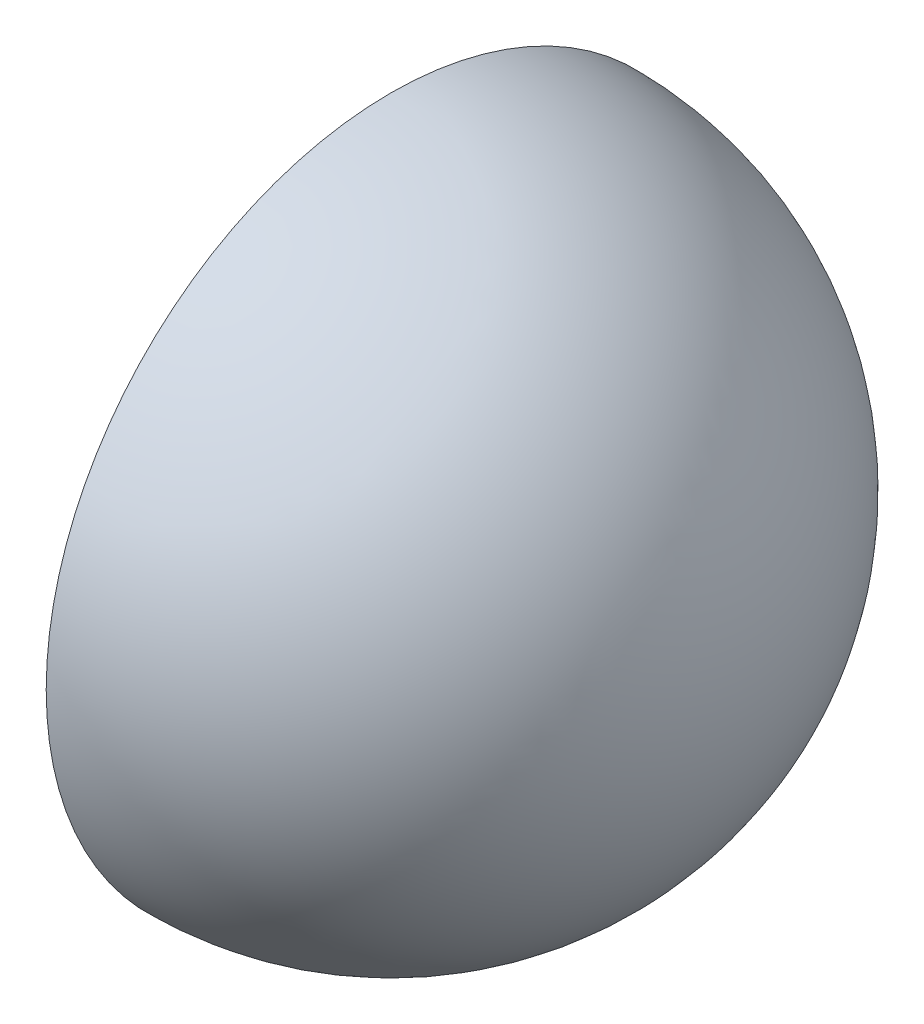
ISO-10303-21;
HEADER;
FILE_DESCRIPTION(('STEP AP214'),'2;1');
FILE_NAME('part.step','',(''),(''),'','','');
FILE_SCHEMA(('AUTOMOTIVE_DESIGN { 1 0 10303 214 1 1 1 1 }'));
ENDSEC;
DATA;
#1=APPLICATION_CONTEXT('core data for automotive mechanical design processes');
#2=APPLICATION_PROTOCOL_DEFINITION('international standard','automotive_design',2000,#1);
#3=PRODUCT_CONTEXT('',#1,'mechanical');
#4=PRODUCT('Part','Part','',(#3));
#5=PRODUCT_RELATED_PRODUCT_CATEGORY('part','',(#4));
#6=PRODUCT_DEFINITION_FORMATION('','',#4);
#7=PRODUCT_DEFINITION_CONTEXT('part definition',#1,'design');
#8=PRODUCT_DEFINITION('design','',#6,#7);
#9=PRODUCT_DEFINITION_SHAPE('','',#8);
#10=(LENGTH_UNIT() NAMED_UNIT(*) SI_UNIT(.MILLI.,.METRE.));
#11=(NAMED_UNIT(*) PLANE_ANGLE_UNIT() SI_UNIT($,.RADIAN.));
#12=(NAMED_UNIT(*) SI_UNIT($,.STERADIAN.) SOLID_ANGLE_UNIT());
#13=UNCERTAINTY_MEASURE_WITH_UNIT(LENGTH_MEASURE(1.E-05),#10,'distance_accuracy_value','');
#14=(GEOMETRIC_REPRESENTATION_CONTEXT(3) GLOBAL_UNCERTAINTY_ASSIGNED_CONTEXT((#13)) GLOBAL_UNIT_ASSIGNED_CONTEXT((#10,
#11,#12)) REPRESENTATION_CONTEXT('',''));
#15=CARTESIAN_POINT('',(0.,0.,0.));
#16=DIRECTION('',(0.,0.,1.));
#17=DIRECTION('',(1.,0.,0.));
#18=AXIS2_PLACEMENT_3D('',#15,#16,#17);
#19=CARTESIAN_POINT('',(0.,0.,0.));
#20=DIRECTION('',(-1.,0.,0.));
#21=DIRECTION('',(0.,-1.,0.));
#22=AXIS2_PLACEMENT_3D('',#19,#20,#21);
#23=SPHERICAL_SURFACE('',#22,37.5);
#24=CARTESIAN_POINT('',(0.,0.,0.));
#25=DIRECTION('',(-1.,0.,0.));
#26=DIRECTION('',(0.,0.,1.));
#27=AXIS2_PLACEMENT_3D('',#24,#25,#26);
#28=CIRCLE('',#27,37.5);
#29=CARTESIAN_POINT('',(0.,0.,37.5));
#30=VERTEX_POINT('',#29);
#31=EDGE_CURVE('E10',#30,#30,#28,.T.);
#32=ORIENTED_EDGE('',*,*,#31,.F.);
#33=EDGE_LOOP('',(#32));
#34=FACE_BOUND('',#33,.T.);
#35=ADVANCED_FACE('F35',(#34),#23,.T.);
#36=CARTESIAN_POINT('',(0.,-37.5,0.));
#37=DIRECTION('',(1.,0.,0.));
#38=DIRECTION('',(0.,0.,-1.));
#39=AXIS2_PLACEMENT_3D('',#36,#37,#38);
#40=PLANE('',#39);
#41=CARTESIAN_POINT('',(0.,0.,0.));
#42=DIRECTION('',(1.,0.,0.));
#43=DIRECTION('',(0.,0.,-1.));
#44=AXIS2_PLACEMENT_3D('',#41,#42,#43);
#45=CIRCLE('',#44,36.5);
#46=CARTESIAN_POINT('',(0.,0.,-36.5));
#47=VERTEX_POINT('',#46);
#48=EDGE_CURVE('E41',#47,#47,#45,.F.);
#49=ORIENTED_EDGE('',*,*,#48,.F.);
#50=EDGE_LOOP('',(#49));
#51=FACE_BOUND('',#50,.T.);
#52=ORIENTED_EDGE('',*,*,#31,.T.);
#53=EDGE_LOOP('',(#52));
#54=FACE_BOUND('',#53,.T.);
#55=ADVANCED_FACE('F49',(#51,#54),#40,.F.);
#56=CARTESIAN_POINT('',(0.,0.,0.));
#57=DIRECTION('',(-1.,0.,0.));
#58=DIRECTION('',(0.,-1.,0.));
#59=AXIS2_PLACEMENT_3D('',#56,#57,#58);
#60=SPHERICAL_SURFACE('',#59,36.5);
#61=ORIENTED_EDGE('',*,*,#48,.T.);
#62=EDGE_LOOP('',(#61));
#63=FACE_BOUND('',#62,.T.);
#64=ADVANCED_FACE('F47',(#63),#60,.F.);
#65=CLOSED_SHELL('',(#35,#55,#64));
#66=MANIFOLD_SOLID_BREP('B2',#65);
#67=ADVANCED_BREP_SHAPE_REPRESENTATION('',(#18,#66),#14);
#68=SHAPE_DEFINITION_REPRESENTATION(#9,#67);
ENDSEC;
END-ISO-10303-21;
